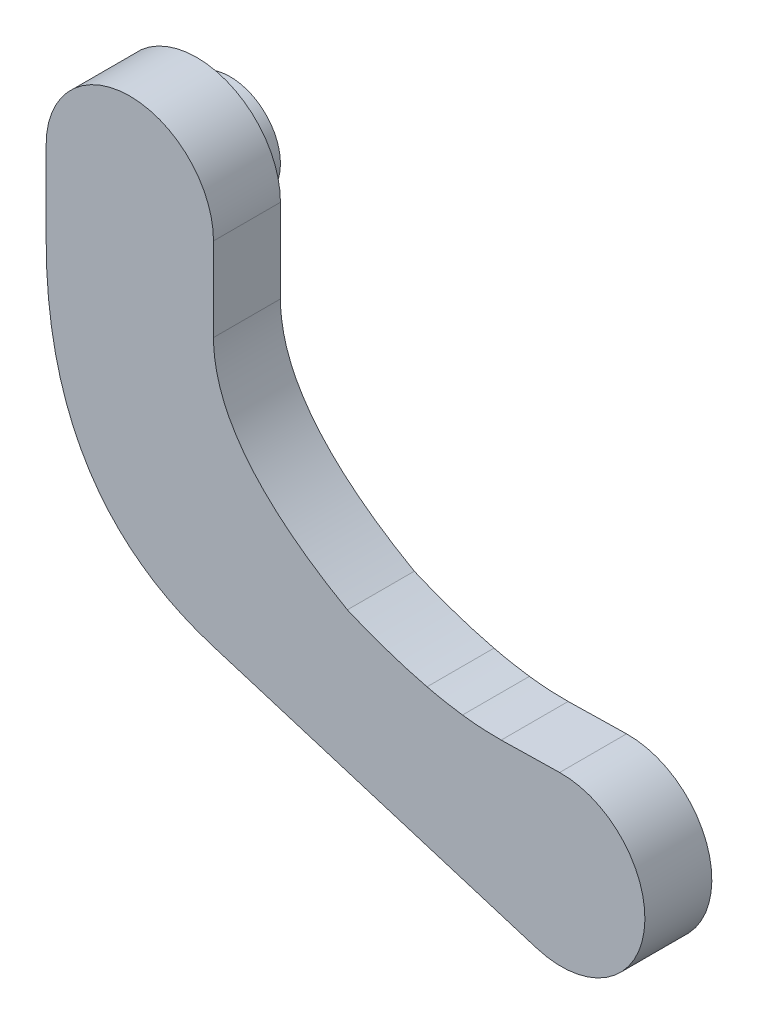
ISO-10303-21;
HEADER;
FILE_DESCRIPTION(('STEP AP214'),'2;1');
FILE_NAME('part.step','',(''),(''),'','','');
FILE_SCHEMA(('AUTOMOTIVE_DESIGN { 1 0 10303 214 1 1 1 1 }'));
ENDSEC;
DATA;
#1=APPLICATION_CONTEXT('core data for automotive mechanical design processes');
#2=APPLICATION_PROTOCOL_DEFINITION('international standard','automotive_design',2000,#1);
#3=PRODUCT_CONTEXT('',#1,'mechanical');
#4=PRODUCT('Part','Part','',(#3));
#5=PRODUCT_RELATED_PRODUCT_CATEGORY('part','',(#4));
#6=PRODUCT_DEFINITION_FORMATION('','',#4);
#7=PRODUCT_DEFINITION_CONTEXT('part definition',#1,'design');
#8=PRODUCT_DEFINITION('design','',#6,#7);
#9=PRODUCT_DEFINITION_SHAPE('','',#8);
#10=(LENGTH_UNIT() NAMED_UNIT(*) SI_UNIT(.MILLI.,.METRE.));
#11=(NAMED_UNIT(*) PLANE_ANGLE_UNIT() SI_UNIT($,.RADIAN.));
#12=(NAMED_UNIT(*) SI_UNIT($,.STERADIAN.) SOLID_ANGLE_UNIT());
#13=UNCERTAINTY_MEASURE_WITH_UNIT(LENGTH_MEASURE(1.E-05),#10,'distance_accuracy_value','');
#14=(GEOMETRIC_REPRESENTATION_CONTEXT(3) GLOBAL_UNCERTAINTY_ASSIGNED_CONTEXT((#13)) GLOBAL_UNIT_ASSIGNED_CONTEXT((#10,
#11,#12)) REPRESENTATION_CONTEXT('',''));
#15=CARTESIAN_POINT('',(0.,0.,0.));
#16=DIRECTION('',(0.,0.,1.));
#17=DIRECTION('',(1.,0.,0.));
#18=AXIS2_PLACEMENT_3D('',#15,#16,#17);
#19=CARTESIAN_POINT('',(18.9450892189157,4.95826516691605,-1.));
#20=DIRECTION('',(0.,0.,-1.));
#21=DIRECTION('',(0.,-1.,0.));
#22=AXIS2_PLACEMENT_3D('',#19,#20,#21);
#23=PLANE('',#22);
#24=CARTESIAN_POINT('',(12.5,10.5,-1.));
#25=DIRECTION('',(0.,0.,1.));
#26=DIRECTION('',(1.,0.,0.));
#27=AXIS2_PLACEMENT_3D('',#24,#25,#26);
#28=CIRCLE('',#27,1.5);
#29=CARTESIAN_POINT('',(14.,10.5,-1.));
#30=VERTEX_POINT('',#29);
#31=EDGE_CURVE('E11',#30,#30,#28,.T.);
#32=ORIENTED_EDGE('',*,*,#31,.F.);
#33=EDGE_LOOP('',(#32));
#34=FACE_BOUND('',#33,.T.);
#35=ADVANCED_FACE('F17',(#34),#23,.T.);
#36=CARTESIAN_POINT('',(12.5,10.5,-1.));
#37=DIRECTION('',(0.,0.,1.));
#38=DIRECTION('',(-1.,0.,0.));
#39=AXIS2_PLACEMENT_3D('',#36,#37,#38);
#40=CYLINDRICAL_SURFACE('',#39,1.5);
#41=CARTESIAN_POINT('',(12.5,10.5,0.));
#42=DIRECTION('',(0.,0.,1.));
#43=DIRECTION('',(1.,0.,0.));
#44=AXIS2_PLACEMENT_3D('',#41,#42,#43);
#45=CIRCLE('',#44,1.5);
#46=CARTESIAN_POINT('',(14.,10.5,0.));
#47=VERTEX_POINT('',#46);
#48=EDGE_CURVE('E27',#47,#47,#45,.T.);
#49=ORIENTED_EDGE('',*,*,#48,.F.);
#50=EDGE_LOOP('',(#49));
#51=FACE_BOUND('',#50,.T.);
#52=ORIENTED_EDGE('',*,*,#31,.T.);
#53=EDGE_LOOP('',(#52));
#54=FACE_BOUND('',#53,.T.);
#55=ADVANCED_FACE('F393',(#51,#54),#40,.T.);
#56=CARTESIAN_POINT('',(15.,4.95826516691604,0.));
#57=DIRECTION('',(0.,0.,1.));
#58=DIRECTION('',(1.,0.,0.));
#59=AXIS2_PLACEMENT_3D('',#56,#57,#58);
#60=PLANE('',#59);
#61=DIRECTION('',(-0.999812744567832,-0.0193513772052415,0.));
#62=VECTOR('',#61,1.);
#63=CARTESIAN_POINT('',(24.7776671423991,1.90514340302746,0.));
#64=LINE('',#63,#62);
#65=CARTESIAN_POINT('',(25.3417999948184,1.91606219525165,0.));
#66=VERTEX_POINT('',#65);
#67=CARTESIAN_POINT('',(23.5973931849003,1.88229919876904,0.));
#68=VERTEX_POINT('',#67);
#69=EDGE_CURVE('E175',#66,#68,#64,.T.);
#70=ORIENTED_EDGE('',*,*,#69,.F.);
#71=CARTESIAN_POINT('',(25.3901784378315,-0.58346966616792,0.));
#72=DIRECTION('',(0.,0.,-1.));
#73=DIRECTION('',(-1.,0.,0.));
#74=AXIS2_PLACEMENT_3D('',#71,#72,#73);
#75=CIRCLE('',#74,2.5);
#76=CARTESIAN_POINT('',(24.6544757225392,-2.97276695087561,0.));
#77=VERTEX_POINT('',#76);
#78=EDGE_CURVE('E301',#66,#77,#75,.T.);
#79=ORIENTED_EDGE('',*,*,#78,.T.);
#80=DIRECTION('',(0.955718913883073,-0.294281086116928,0.));
#81=VECTOR('',#80,1.);
#82=CARTESIAN_POINT('',(22.4382008114105,-2.29034058209032,0.));
#83=LINE('',#82,#81);
#84=CARTESIAN_POINT('',(15.,0.,0.));
#85=VERTEX_POINT('',#84);
#86=EDGE_CURVE('E186',#85,#77,#83,.T.);
#87=ORIENTED_EDGE('',*,*,#86,.F.);
#88=CARTESIAN_POINT('',(15.,0.,0.));
#89=CARTESIAN_POINT('',(13.5355339127904,0.450932449347952,0.));
#90=CARTESIAN_POINT('',(12.5000000096982,1.32400628140679,0.));
#91=(BOUNDED_CURVE() B_SPLINE_CURVE(2,(#88,#89,#90),.UNSPECIFIED.,.F.,
.F.) B_SPLINE_CURVE_WITH_KNOTS((3,3),(0.,0.292893217441925),
.UNSPECIFIED.) CURVE() GEOMETRIC_REPRESENTATION_ITEM() RATIONAL_B_SPLINE_CURVE((1.,1.,1.)) REPRESENTATION_ITEM(''));
#92=CARTESIAN_POINT('',(12.5000000096982,1.32400628140679,0.));
#93=VERTEX_POINT('',#92);
#94=EDGE_CURVE('E87',#85,#93,#91,.T.);
#95=ORIENTED_EDGE('',*,*,#94,.T.);
#96=CARTESIAN_POINT('',(12.5000000096982,1.32400628140679,0.));
#97=CARTESIAN_POINT('',(10.,3.43179298167471,0.));
#98=CARTESIAN_POINT('',(10.,8.,0.));
#99=(BOUNDED_CURVE() B_SPLINE_CURVE(2,(#96,#97,#98),.UNSPECIFIED.,.F.,
.F.) B_SPLINE_CURVE_WITH_KNOTS((3,3),(0.292893217441925,1.),
.UNSPECIFIED.) CURVE() GEOMETRIC_REPRESENTATION_ITEM() RATIONAL_B_SPLINE_CURVE((1.,1.,1.)) REPRESENTATION_ITEM(''));
#100=CARTESIAN_POINT('',(10.,8.,0.));
#101=VERTEX_POINT('',#100);
#102=EDGE_CURVE('E266',#93,#101,#99,.T.);
#103=ORIENTED_EDGE('',*,*,#102,.T.);
#104=DIRECTION('',(0.,1.,0.));
#105=VECTOR('',#104,1.);
#106=CARTESIAN_POINT('',(10.,9.25,0.));
#107=LINE('',#106,#105);
#108=CARTESIAN_POINT('',(10.,10.5,0.));
#109=VERTEX_POINT('',#108);
#110=EDGE_CURVE('E202',#101,#109,#107,.T.);
#111=ORIENTED_EDGE('',*,*,#110,.T.);
#112=CARTESIAN_POINT('',(12.5,10.5,0.));
#113=DIRECTION('',(0.,0.,1.));
#114=DIRECTION('',(-1.,0.,0.));
#115=AXIS2_PLACEMENT_3D('',#112,#113,#114);
#116=CIRCLE('',#115,2.5);
#117=CARTESIAN_POINT('',(15.,10.5,0.));
#118=VERTEX_POINT('',#117);
#119=EDGE_CURVE('E190',#118,#109,#116,.T.);
#120=ORIENTED_EDGE('',*,*,#119,.F.);
#121=DIRECTION('',(0.,-1.,0.));
#122=VECTOR('',#121,1.);
#123=CARTESIAN_POINT('',(15.,8.17520207152069,0.));
#124=LINE('',#123,#122);
#125=CARTESIAN_POINT('',(15.,8.,0.));
#126=VERTEX_POINT('',#125);
#127=EDGE_CURVE('E258',#118,#126,#124,.T.);
#128=ORIENTED_EDGE('',*,*,#127,.T.);
#129=CARTESIAN_POINT('',(19.,2.95366724936204,0.));
#130=CARTESIAN_POINT('',(15.,5.23166375318981,0.));
#131=CARTESIAN_POINT('',(15.,8.,0.));
#132=(BOUNDED_CURVE() B_SPLINE_CURVE(2,(#129,#130,#131),.UNSPECIFIED.,.F.,
.F.) B_SPLINE_CURVE_WITH_KNOTS((3,3),(0.,1.),
.UNSPECIFIED.) CURVE() GEOMETRIC_REPRESENTATION_ITEM() RATIONAL_B_SPLINE_CURVE((1.,1.,1.)) REPRESENTATION_ITEM(''));
#133=CARTESIAN_POINT('',(19.,2.95366724936204,0.));
#134=VERTEX_POINT('',#133);
#135=EDGE_CURVE('E155',#134,#126,#132,.T.);
#136=ORIENTED_EDGE('',*,*,#135,.F.);
#137=CARTESIAN_POINT('',(21.3798526232398,2.15261447615738,0.));
#138=CARTESIAN_POINT('',(20.2652084525949,2.4206888880086,0.));
#139=CARTESIAN_POINT('',(19.,2.95366724936204,0.));
#140=(BOUNDED_CURVE() B_SPLINE_CURVE(2,(#137,#138,#139),.UNSPECIFIED.,.F.,
.F.) B_SPLINE_CURVE_WITH_KNOTS((3,3),(0.517468519952534,1.),
.UNSPECIFIED.) CURVE() GEOMETRIC_REPRESENTATION_ITEM() RATIONAL_B_SPLINE_CURVE((1.,1.,1.)) REPRESENTATION_ITEM(''));
#141=CARTESIAN_POINT('',(21.379852620456,2.15261447701456,0.));
#142=VERTEX_POINT('',#141);
#143=EDGE_CURVE('E139',#142,#134,#140,.T.);
#144=ORIENTED_EDGE('',*,*,#143,.F.);
#145=CARTESIAN_POINT('',(22.4403096712738,1.95294060461028,0.));
#146=CARTESIAN_POINT('',(21.9283075673137,2.02070983750089,0.));
#147=CARTESIAN_POINT('',(21.3798526232398,2.15261447615738,0.));
#148=(BOUNDED_CURVE() B_SPLINE_CURVE(2,(#145,#146,#147),.UNSPECIFIED.,.F.,
.F.) B_SPLINE_CURVE_WITH_KNOTS((3,3),(0.280041381433362,0.517468519952534),
.UNSPECIFIED.) CURVE() GEOMETRIC_REPRESENTATION_ITEM() RATIONAL_B_SPLINE_CURVE((1.,1.,1.)) REPRESENTATION_ITEM(''));
#149=CARTESIAN_POINT('',(22.4403096712738,1.95294060461028,0.));
#150=VERTEX_POINT('',#149);
#151=EDGE_CURVE('E117',#150,#142,#148,.T.);
#152=ORIENTED_EDGE('',*,*,#151,.F.);
#153=CARTESIAN_POINT('',(23.5973931849003,1.88229919876904,0.));
#154=CARTESIAN_POINT('',(23.0442076813498,1.87300791571998,0.));
#155=CARTESIAN_POINT('',(22.4403096712738,1.95294060461028,0.));
#156=(BOUNDED_CURVE() B_SPLINE_CURVE(2,(#153,#154,#155),.UNSPECIFIED.,.F.,
.F.) B_SPLINE_CURVE_WITH_KNOTS((3,3),(0.,0.280041381433362),
.UNSPECIFIED.) CURVE() GEOMETRIC_REPRESENTATION_ITEM() RATIONAL_B_SPLINE_CURVE((1.,1.,1.)) REPRESENTATION_ITEM(''));
#157=EDGE_CURVE('E285',#68,#150,#156,.T.);
#158=ORIENTED_EDGE('',*,*,#157,.F.);
#159=EDGE_LOOP('',(#70,#79,#87,#95,#103,#111,#120,#128,#136,#144,#152,#158));
#160=FACE_BOUND('',#159,.T.);
#161=ORIENTED_EDGE('',*,*,#48,.T.);
#162=EDGE_LOOP('',(#161));
#163=FACE_BOUND('',#162,.T.);
#164=ADVANCED_FACE('F344',(#160,#163),#60,.F.);
#165=CARTESIAN_POINT('',(15.,4.95826516691604,2.));
#166=DIRECTION('',(0.,0.,1.));
#167=DIRECTION('',(1.,0.,0.));
#168=AXIS2_PLACEMENT_3D('',#165,#166,#167);
#169=PLANE('',#168);
#170=DIRECTION('',(-0.999812744567832,-0.0193513772052415,0.));
#171=VECTOR('',#170,1.);
#172=CARTESIAN_POINT('',(24.7776671423991,1.90514340302746,2.));
#173=LINE('',#172,#171);
#174=CARTESIAN_POINT('',(25.3417999948184,1.91606219525165,2.));
#175=VERTEX_POINT('',#174);
#176=CARTESIAN_POINT('',(23.5973931849003,1.88229919876904,2.));
#177=VERTEX_POINT('',#176);
#178=EDGE_CURVE('E174',#175,#177,#173,.T.);
#179=ORIENTED_EDGE('',*,*,#178,.T.);
#180=CARTESIAN_POINT('',(23.5973931849003,1.88229919876904,2.));
#181=CARTESIAN_POINT('',(23.0442076813498,1.87300791571998,2.));
#182=CARTESIAN_POINT('',(22.4403096712738,1.95294060461028,2.));
#183=(BOUNDED_CURVE() B_SPLINE_CURVE(2,(#180,#181,#182),.UNSPECIFIED.,.F.,
.F.) B_SPLINE_CURVE_WITH_KNOTS((3,3),(0.,0.280041381433362),
.UNSPECIFIED.) CURVE() GEOMETRIC_REPRESENTATION_ITEM() RATIONAL_B_SPLINE_CURVE((1.,1.,1.)) REPRESENTATION_ITEM(''));
#184=CARTESIAN_POINT('',(22.4403096712738,1.95294060461028,2.));
#185=VERTEX_POINT('',#184);
#186=EDGE_CURVE('E257',#177,#185,#183,.T.);
#187=ORIENTED_EDGE('',*,*,#186,.T.);
#188=CARTESIAN_POINT('',(22.4403096712738,1.95294060461028,2.));
#189=CARTESIAN_POINT('',(21.9283075673137,2.02070983750089,2.));
#190=CARTESIAN_POINT('',(21.3798526232398,2.15261447615738,2.));
#191=(BOUNDED_CURVE() B_SPLINE_CURVE(2,(#188,#189,#190),.UNSPECIFIED.,.F.,
.F.) B_SPLINE_CURVE_WITH_KNOTS((3,3),(0.280041381433362,0.517468519952534),
.UNSPECIFIED.) CURVE() GEOMETRIC_REPRESENTATION_ITEM() RATIONAL_B_SPLINE_CURVE((1.,1.,1.)) REPRESENTATION_ITEM(''));
#192=CARTESIAN_POINT('',(21.379852620456,2.15261447701456,2.));
#193=VERTEX_POINT('',#192);
#194=EDGE_CURVE('E135',#185,#193,#191,.T.);
#195=ORIENTED_EDGE('',*,*,#194,.T.);
#196=CARTESIAN_POINT('',(21.3798526232398,2.15261447615738,2.));
#197=CARTESIAN_POINT('',(20.2652084525949,2.4206888880086,2.));
#198=CARTESIAN_POINT('',(19.,2.95366724936204,2.));
#199=(BOUNDED_CURVE() B_SPLINE_CURVE(2,(#196,#197,#198),.UNSPECIFIED.,.F.,
.F.) B_SPLINE_CURVE_WITH_KNOTS((3,3),(0.517468519952534,1.),
.UNSPECIFIED.) CURVE() GEOMETRIC_REPRESENTATION_ITEM() RATIONAL_B_SPLINE_CURVE((1.,1.,1.)) REPRESENTATION_ITEM(''));
#200=CARTESIAN_POINT('',(19.,2.95366724936204,2.));
#201=VERTEX_POINT('',#200);
#202=EDGE_CURVE('E127',#193,#201,#199,.T.);
#203=ORIENTED_EDGE('',*,*,#202,.T.);
#204=CARTESIAN_POINT('',(19.,2.95366724936204,2.));
#205=CARTESIAN_POINT('',(15.,5.23166375318981,2.));
#206=CARTESIAN_POINT('',(15.,8.,2.));
#207=(BOUNDED_CURVE() B_SPLINE_CURVE(2,(#204,#205,#206),.UNSPECIFIED.,.F.,
.F.) B_SPLINE_CURVE_WITH_KNOTS((3,3),(0.,1.),
.UNSPECIFIED.) CURVE() GEOMETRIC_REPRESENTATION_ITEM() RATIONAL_B_SPLINE_CURVE((1.,1.,1.)) REPRESENTATION_ITEM(''));
#208=CARTESIAN_POINT('',(15.,8.,2.));
#209=VERTEX_POINT('',#208);
#210=EDGE_CURVE('E132',#201,#209,#207,.T.);
#211=ORIENTED_EDGE('',*,*,#210,.T.);
#212=DIRECTION('',(0.,-1.,0.));
#213=VECTOR('',#212,1.);
#214=CARTESIAN_POINT('',(15.,8.17520207152069,2.));
#215=LINE('',#214,#213);
#216=CARTESIAN_POINT('',(15.,10.5,2.));
#217=VERTEX_POINT('',#216);
#218=EDGE_CURVE('E222',#217,#209,#215,.T.);
#219=ORIENTED_EDGE('',*,*,#218,.F.);
#220=CARTESIAN_POINT('',(12.5,10.5,2.));
#221=DIRECTION('',(0.,0.,1.));
#222=DIRECTION('',(-1.,0.,0.));
#223=AXIS2_PLACEMENT_3D('',#220,#221,#222);
#224=CIRCLE('',#223,2.5);
#225=CARTESIAN_POINT('',(10.,10.5,2.));
#226=VERTEX_POINT('',#225);
#227=EDGE_CURVE('E200',#217,#226,#224,.T.);
#228=ORIENTED_EDGE('',*,*,#227,.T.);
#229=DIRECTION('',(0.,1.,0.));
#230=VECTOR('',#229,1.);
#231=CARTESIAN_POINT('',(10.,9.25,2.));
#232=LINE('',#231,#230);
#233=CARTESIAN_POINT('',(10.,8.,2.));
#234=VERTEX_POINT('',#233);
#235=EDGE_CURVE('E166',#234,#226,#232,.T.);
#236=ORIENTED_EDGE('',*,*,#235,.F.);
#237=CARTESIAN_POINT('',(12.5000000096982,1.32400628140679,2.));
#238=CARTESIAN_POINT('',(10.,3.43179298167471,2.));
#239=CARTESIAN_POINT('',(10.,8.,2.));
#240=(BOUNDED_CURVE() B_SPLINE_CURVE(2,(#237,#238,#239),.UNSPECIFIED.,.F.,
.F.) B_SPLINE_CURVE_WITH_KNOTS((3,3),(0.292893217441925,1.),
.UNSPECIFIED.) CURVE() GEOMETRIC_REPRESENTATION_ITEM() RATIONAL_B_SPLINE_CURVE((1.,1.,1.)) REPRESENTATION_ITEM(''));
#241=CARTESIAN_POINT('',(12.5000000096982,1.32400628140679,2.));
#242=VERTEX_POINT('',#241);
#243=EDGE_CURVE('E218',#242,#234,#240,.T.);
#244=ORIENTED_EDGE('',*,*,#243,.F.);
#245=CARTESIAN_POINT('',(15.,0.,2.));
#246=CARTESIAN_POINT('',(13.5355339127904,0.450932449347952,2.));
#247=CARTESIAN_POINT('',(12.5000000096982,1.32400628140679,2.));
#248=(BOUNDED_CURVE() B_SPLINE_CURVE(2,(#245,#246,#247),.UNSPECIFIED.,.F.,
.F.) B_SPLINE_CURVE_WITH_KNOTS((3,3),(0.,0.292893217441925),
.UNSPECIFIED.) CURVE() GEOMETRIC_REPRESENTATION_ITEM() RATIONAL_B_SPLINE_CURVE((1.,1.,1.)) REPRESENTATION_ITEM(''));
#249=CARTESIAN_POINT('',(15.,0.,2.));
#250=VERTEX_POINT('',#249);
#251=EDGE_CURVE('E75',#250,#242,#248,.T.);
#252=ORIENTED_EDGE('',*,*,#251,.F.);
#253=DIRECTION('',(0.955718913883073,-0.294281086116928,0.));
#254=VECTOR('',#253,1.);
#255=CARTESIAN_POINT('',(22.4382008114105,-2.29034058209032,2.));
#256=LINE('',#255,#254);
#257=CARTESIAN_POINT('',(24.6544757225392,-2.97276695087561,2.));
#258=VERTEX_POINT('',#257);
#259=EDGE_CURVE('E183',#250,#258,#256,.T.);
#260=ORIENTED_EDGE('',*,*,#259,.T.);
#261=CARTESIAN_POINT('',(25.3901784378315,-0.58346966616792,2.));
#262=DIRECTION('',(0.,0.,-1.));
#263=DIRECTION('',(-1.,0.,0.));
#264=AXIS2_PLACEMENT_3D('',#261,#262,#263);
#265=CIRCLE('',#264,2.5);
#266=EDGE_CURVE('E293',#175,#258,#265,.T.);
#267=ORIENTED_EDGE('',*,*,#266,.F.);
#268=EDGE_LOOP('',(#179,#187,#195,#203,#211,#219,#228,#236,#244,#252,#260,#267));
#269=FACE_BOUND('',#268,.T.);
#270=ADVANCED_FACE('F130',(#269),#169,.T.);
#271=CARTESIAN_POINT('',(23.5973931849003,1.88229919876904,2.));
#272=CARTESIAN_POINT('',(23.5973931849003,1.88229919876904,0.));
#273=CARTESIAN_POINT('',(23.2286028492,1.87610501006967,2.));
#274=CARTESIAN_POINT('',(23.2286028492,1.87610501006967,0.));
#275=CARTESIAN_POINT('',(22.8429083446578,1.89965214535008,2.));
#276=CARTESIAN_POINT('',(22.8429083446578,1.89965214535008,0.));
#277=CARTESIAN_POINT('',(22.4403096712738,1.95294060461028,2.));
#278=CARTESIAN_POINT('',(22.4403096712738,1.95294060461028,0.));
#279=(BOUNDED_SURFACE() B_SPLINE_SURFACE(3,1,((#271,#272),(#273,#274),(#275,#276),(#277,#278)),
.UNSPECIFIED.,.F.,.F.,.F.) B_SPLINE_SURFACE_WITH_KNOTS((4,4),(2,2),(0.,0.280041381433362),(0.,
1.),.UNSPECIFIED.) GEOMETRIC_REPRESENTATION_ITEM() RATIONAL_B_SPLINE_SURFACE(((1.,1.),(1.,1.),
(1.,1.),(1.,1.))) REPRESENTATION_ITEM('') SURFACE());
#280=DIRECTION('',(0.,0.,-1.));
#281=VECTOR('',#280,1.);
#282=CARTESIAN_POINT('',(22.4403096712738,1.95294060461028,2.));
#283=LINE('',#282,#281);
#284=EDGE_CURVE('E237',#185,#150,#283,.T.);
#285=DIRECTION('',(0.,0.,-1.));
#286=VECTOR('',#285,1.);
#287=CARTESIAN_POINT('',(23.5973931849003,1.88229919876904,2.));
#288=LINE('',#287,#286);
#289=EDGE_CURVE('E168',#177,#68,#288,.T.);
#290=ORIENTED_EDGE('',*,*,#157,.T.);
#291=ORIENTED_EDGE('',*,*,#284,.F.);
#292=ORIENTED_EDGE('',*,*,#186,.F.);
#293=ORIENTED_EDGE('',*,*,#289,.T.);
#294=EDGE_LOOP('',(#290,#291,#292,#293));
#295=FACE_BOUND('',#294,.T.);
#296=ADVANCED_FACE('F426',(#295),#279,.F.);
#297=CARTESIAN_POINT('',(22.4403096712738,1.95294060461028,2.));
#298=CARTESIAN_POINT('',(22.4403096712738,1.95294060461028,0.));
#299=CARTESIAN_POINT('',(22.0989749353004,1.99812009320402,2.));
#300=CARTESIAN_POINT('',(22.0989749353004,1.99812009320402,0.));
#301=CARTESIAN_POINT('',(21.7454892526224,2.06467805038639,2.));
#302=CARTESIAN_POINT('',(21.7454892526224,2.06467805038639,0.));
#303=CARTESIAN_POINT('',(21.3798526232398,2.15261447615738,2.));
#304=CARTESIAN_POINT('',(21.3798526232398,2.15261447615738,0.));
#305=(BOUNDED_SURFACE() B_SPLINE_SURFACE(3,1,((#297,#298),(#299,#300),(#301,#302),(#303,#304)),
.UNSPECIFIED.,.F.,.F.,.F.) B_SPLINE_SURFACE_WITH_KNOTS((4,4),(2,2),(0.280041381433362,
0.517468519952534),(0.,1.),
.UNSPECIFIED.) GEOMETRIC_REPRESENTATION_ITEM() RATIONAL_B_SPLINE_SURFACE(((1.,1.),(1.,1.),(1.,
1.),(1.,1.))) REPRESENTATION_ITEM('') SURFACE());
#306=DIRECTION('',(0.,0.,-1.));
#307=VECTOR('',#306,1.);
#308=CARTESIAN_POINT('',(21.379852620456,2.15261447701456,2.));
#309=LINE('',#308,#307);
#310=EDGE_CURVE('E138',#193,#142,#309,.T.);
#311=ORIENTED_EDGE('',*,*,#151,.T.);
#312=ORIENTED_EDGE('',*,*,#310,.F.);
#313=ORIENTED_EDGE('',*,*,#194,.F.);
#314=ORIENTED_EDGE('',*,*,#284,.T.);
#315=EDGE_LOOP('',(#311,#312,#313,#314));
#316=FACE_BOUND('',#315,.T.);
#317=ADVANCED_FACE('F338',(#316),#305,.F.);
#318=CARTESIAN_POINT('',(21.3798526232398,2.15261447615738,2.));
#319=CARTESIAN_POINT('',(21.3798526232398,2.15261447615738,0.));
#320=CARTESIAN_POINT('',(20.6367565094766,2.33133075072486,2.));
#321=CARTESIAN_POINT('',(20.6367565094766,2.33133075072486,0.));
#322=CARTESIAN_POINT('',(19.8434723017299,2.59834834179308,2.));
#323=CARTESIAN_POINT('',(19.8434723017299,2.59834834179308,0.));
#324=CARTESIAN_POINT('',(19.,2.95366724936204,2.));
#325=CARTESIAN_POINT('',(19.,2.95366724936204,0.));
#326=(BOUNDED_SURFACE() B_SPLINE_SURFACE(3,1,((#318,#319),(#320,#321),(#322,#323),(#324,#325)),
.UNSPECIFIED.,.F.,.F.,.F.) B_SPLINE_SURFACE_WITH_KNOTS((4,4),(2,2),(0.517468519952534,1.),(0.,
1.),.UNSPECIFIED.) GEOMETRIC_REPRESENTATION_ITEM() RATIONAL_B_SPLINE_SURFACE(((1.,1.),(1.,1.),
(1.,1.),(1.,1.))) REPRESENTATION_ITEM('') SURFACE());
#327=DIRECTION('',(0.,0.,-1.));
#328=VECTOR('',#327,1.);
#329=CARTESIAN_POINT('',(19.,2.95366724936204,2.));
#330=LINE('',#329,#328);
#331=EDGE_CURVE('E142',#201,#134,#330,.T.);
#332=ORIENTED_EDGE('',*,*,#143,.T.);
#333=ORIENTED_EDGE('',*,*,#331,.F.);
#334=ORIENTED_EDGE('',*,*,#202,.F.);
#335=ORIENTED_EDGE('',*,*,#310,.T.);
#336=EDGE_LOOP('',(#332,#333,#334,#335));
#337=FACE_BOUND('',#336,.T.);
#338=ADVANCED_FACE('F143',(#337),#326,.F.);
#339=CARTESIAN_POINT('',(19.,2.95366724936204,2.));
#340=CARTESIAN_POINT('',(19.,2.95366724936204,0.));
#341=CARTESIAN_POINT('',(16.3333333333333,4.47233158524722,2.));
#342=CARTESIAN_POINT('',(16.3333333333333,4.47233158524722,0.));
#343=CARTESIAN_POINT('',(15.,6.15444250212654,2.));
#344=CARTESIAN_POINT('',(15.,6.15444250212654,0.));
#345=CARTESIAN_POINT('',(15.,8.,2.));
#346=CARTESIAN_POINT('',(15.,8.,0.));
#347=(BOUNDED_SURFACE() B_SPLINE_SURFACE(3,1,((#339,#340),(#341,#342),(#343,#344),(#345,#346)),
.UNSPECIFIED.,.F.,.F.,.F.) B_SPLINE_SURFACE_WITH_KNOTS((4,4),(2,2),(0.,1.),(0.,1.),
.UNSPECIFIED.) GEOMETRIC_REPRESENTATION_ITEM() RATIONAL_B_SPLINE_SURFACE(((1.,1.),(1.,1.),(1.,
1.),(1.,1.))) REPRESENTATION_ITEM('') SURFACE());
#348=DIRECTION('',(0.,0.,-1.));
#349=VECTOR('',#348,1.);
#350=CARTESIAN_POINT('',(15.,8.,2.));
#351=LINE('',#350,#349);
#352=EDGE_CURVE('E152',#209,#126,#351,.T.);
#353=ORIENTED_EDGE('',*,*,#135,.T.);
#354=ORIENTED_EDGE('',*,*,#352,.F.);
#355=ORIENTED_EDGE('',*,*,#210,.F.);
#356=ORIENTED_EDGE('',*,*,#331,.T.);
#357=EDGE_LOOP('',(#353,#354,#355,#356));
#358=FACE_BOUND('',#357,.T.);
#359=ADVANCED_FACE('F150',(#358),#347,.F.);
#360=CARTESIAN_POINT('',(15.,8.17520207152069,2.));
#361=DIRECTION('',(-1.,0.,0.));
#362=DIRECTION('',(0.,0.,1.));
#363=AXIS2_PLACEMENT_3D('',#360,#361,#362);
#364=PLANE('',#363);
#365=ORIENTED_EDGE('',*,*,#127,.F.);
#366=DIRECTION('',(0.,0.,-1.));
#367=VECTOR('',#366,1.);
#368=CARTESIAN_POINT('',(15.,10.5,2.));
#369=LINE('',#368,#367);
#370=EDGE_CURVE('E226',#217,#118,#369,.T.);
#371=ORIENTED_EDGE('',*,*,#370,.F.);
#372=ORIENTED_EDGE('',*,*,#218,.T.);
#373=ORIENTED_EDGE('',*,*,#352,.T.);
#374=EDGE_LOOP('',(#365,#371,#372,#373));
#375=FACE_BOUND('',#374,.T.);
#376=ADVANCED_FACE('F348',(#375),#364,.F.);
#377=CARTESIAN_POINT('',(12.5,10.5,2.));
#378=DIRECTION('',(0.,0.,-1.));
#379=DIRECTION('',(1.,0.,0.));
#380=AXIS2_PLACEMENT_3D('',#377,#378,#379);
#381=CYLINDRICAL_SURFACE('',#380,2.5);
#382=ORIENTED_EDGE('',*,*,#119,.T.);
#383=DIRECTION('',(0.,0.,-1.));
#384=VECTOR('',#383,1.);
#385=CARTESIAN_POINT('',(10.,10.5,2.));
#386=LINE('',#385,#384);
#387=EDGE_CURVE('E187',#226,#109,#386,.T.);
#388=ORIENTED_EDGE('',*,*,#387,.F.);
#389=ORIENTED_EDGE('',*,*,#227,.F.);
#390=ORIENTED_EDGE('',*,*,#370,.T.);
#391=EDGE_LOOP('',(#382,#388,#389,#390));
#392=FACE_BOUND('',#391,.T.);
#393=ADVANCED_FACE('F356',(#392),#381,.T.);
#394=CARTESIAN_POINT('',(10.,9.25,2.));
#395=DIRECTION('',(1.,0.,0.));
#396=DIRECTION('',(0.,1.,0.));
#397=AXIS2_PLACEMENT_3D('',#394,#395,#396);
#398=PLANE('',#397);
#399=ORIENTED_EDGE('',*,*,#110,.F.);
#400=DIRECTION('',(0.,0.,-1.));
#401=VECTOR('',#400,1.);
#402=CARTESIAN_POINT('',(10.,8.,2.));
#403=LINE('',#402,#401);
#404=EDGE_CURVE('E208',#234,#101,#403,.T.);
#405=ORIENTED_EDGE('',*,*,#404,.F.);
#406=ORIENTED_EDGE('',*,*,#235,.T.);
#407=ORIENTED_EDGE('',*,*,#387,.T.);
#408=EDGE_LOOP('',(#399,#405,#406,#407));
#409=FACE_BOUND('',#408,.T.);
#410=ADVANCED_FACE('F409',(#409),#398,.F.);
#411=CARTESIAN_POINT('',(12.5000000096982,1.32400628140679,2.));
#412=CARTESIAN_POINT('',(12.5000000096982,1.32400628140679,0.));
#413=CARTESIAN_POINT('',(10.8333333365661,2.72919741491874,2.));
#414=CARTESIAN_POINT('',(10.8333333365661,2.72919741491874,0.));
#415=CARTESIAN_POINT('',(10.,4.95452865444981,2.));
#416=CARTESIAN_POINT('',(10.,4.95452865444981,0.));
#417=CARTESIAN_POINT('',(10.,8.,2.));
#418=CARTESIAN_POINT('',(10.,8.,0.));
#419=(BOUNDED_SURFACE() B_SPLINE_SURFACE(3,1,((#411,#412),(#413,#414),(#415,#416),(#417,#418)),
.UNSPECIFIED.,.F.,.F.,.F.) B_SPLINE_SURFACE_WITH_KNOTS((4,4),(2,2),(0.292893217441925,1.),(0.,
1.),.UNSPECIFIED.) GEOMETRIC_REPRESENTATION_ITEM() RATIONAL_B_SPLINE_SURFACE(((1.,1.),(1.,1.),
(1.,1.),(1.,1.))) REPRESENTATION_ITEM('') SURFACE());
#420=DIRECTION('',(0.,0.,-1.));
#421=VECTOR('',#420,1.);
#422=CARTESIAN_POINT('',(12.5000000096982,1.32400628140679,2.));
#423=LINE('',#422,#421);
#424=EDGE_CURVE('E309',#242,#93,#423,.T.);
#425=ORIENTED_EDGE('',*,*,#102,.F.);
#426=ORIENTED_EDGE('',*,*,#424,.F.);
#427=ORIENTED_EDGE('',*,*,#243,.T.);
#428=ORIENTED_EDGE('',*,*,#404,.T.);
#429=EDGE_LOOP('',(#425,#426,#427,#428));
#430=FACE_BOUND('',#429,.T.);
#431=ADVANCED_FACE('F418',(#430),#419,.T.);
#432=CARTESIAN_POINT('',(15.,0.,2.));
#433=CARTESIAN_POINT('',(15.,0.,0.));
#434=CARTESIAN_POINT('',(14.0236892751936,0.300621632898634,2.));
#435=CARTESIAN_POINT('',(14.0236892751936,0.300621632898634,0.));
#436=CARTESIAN_POINT('',(13.190355945093,0.74195706003423,2.));
#437=CARTESIAN_POINT('',(13.190355945093,0.74195706003423,0.));
#438=CARTESIAN_POINT('',(12.5000000096982,1.32400628140679,2.));
#439=CARTESIAN_POINT('',(12.5000000096982,1.32400628140679,0.));
#440=(BOUNDED_SURFACE() B_SPLINE_SURFACE(3,1,((#432,#433),(#434,#435),(#436,#437),(#438,#439)),
.UNSPECIFIED.,.F.,.F.,.F.) B_SPLINE_SURFACE_WITH_KNOTS((4,4),(2,2),(0.,0.292893217441925),(0.,
1.),.UNSPECIFIED.) GEOMETRIC_REPRESENTATION_ITEM() RATIONAL_B_SPLINE_SURFACE(((1.,1.),(1.,1.),
(1.,1.),(1.,1.))) REPRESENTATION_ITEM('') SURFACE());
#441=DIRECTION('',(0.,0.,-1.));
#442=VECTOR('',#441,1.);
#443=CARTESIAN_POINT('',(15.,0.,2.));
#444=LINE('',#443,#442);
#445=EDGE_CURVE('E185',#250,#85,#444,.T.);
#446=ORIENTED_EDGE('',*,*,#94,.F.);
#447=ORIENTED_EDGE('',*,*,#445,.F.);
#448=ORIENTED_EDGE('',*,*,#251,.T.);
#449=ORIENTED_EDGE('',*,*,#424,.T.);
#450=EDGE_LOOP('',(#446,#447,#448,#449));
#451=FACE_BOUND('',#450,.T.);
#452=ADVANCED_FACE('F414',(#451),#440,.T.);
#453=CARTESIAN_POINT('',(22.4382008114105,-2.29034058209032,2.));
#454=DIRECTION('',(-0.294281086116928,-0.955718913883073,0.));
#455=DIRECTION('',(-0.955718913883073,0.294281086116928,0.));
#456=AXIS2_PLACEMENT_3D('',#453,#454,#455);
#457=PLANE('',#456);
#458=ORIENTED_EDGE('',*,*,#86,.T.);
#459=DIRECTION('',(0.,0.,-1.));
#460=VECTOR('',#459,1.);
#461=CARTESIAN_POINT('',(24.6544757225392,-2.97276695087561,2.));
#462=LINE('',#461,#460);
#463=EDGE_CURVE('E300',#258,#77,#462,.T.);
#464=ORIENTED_EDGE('',*,*,#463,.F.);
#465=ORIENTED_EDGE('',*,*,#259,.F.);
#466=ORIENTED_EDGE('',*,*,#445,.T.);
#467=EDGE_LOOP('',(#458,#464,#465,#466));
#468=FACE_BOUND('',#467,.T.);
#469=ADVANCED_FACE('F376',(#468),#457,.T.);
#470=CARTESIAN_POINT('',(25.3901784378315,-0.58346966616792,2.));
#471=DIRECTION('',(0.,0.,-1.));
#472=DIRECTION('',(1.,0.,0.));
#473=AXIS2_PLACEMENT_3D('',#470,#471,#472);
#474=CYLINDRICAL_SURFACE('',#473,2.5);
#475=ORIENTED_EDGE('',*,*,#78,.F.);
#476=DIRECTION('',(0.,0.,-1.));
#477=VECTOR('',#476,1.);
#478=CARTESIAN_POINT('',(25.3417999948184,1.91606219525165,2.));
#479=LINE('',#478,#477);
#480=EDGE_CURVE('E20',#175,#66,#479,.T.);
#481=ORIENTED_EDGE('',*,*,#480,.F.);
#482=ORIENTED_EDGE('',*,*,#266,.T.);
#483=ORIENTED_EDGE('',*,*,#463,.T.);
#484=EDGE_LOOP('',(#475,#481,#482,#483));
#485=FACE_BOUND('',#484,.T.);
#486=ADVANCED_FACE('F380',(#485),#474,.T.);
#487=CARTESIAN_POINT('',(24.7776671423991,1.90514340302746,2.));
#488=DIRECTION('',(-0.0193513772052415,0.999812744567832,0.));
#489=DIRECTION('',(0.,0.,1.));
#490=AXIS2_PLACEMENT_3D('',#487,#488,#489);
#491=PLANE('',#490);
#492=ORIENTED_EDGE('',*,*,#69,.T.);
#493=ORIENTED_EDGE('',*,*,#289,.F.);
#494=ORIENTED_EDGE('',*,*,#178,.F.);
#495=ORIENTED_EDGE('',*,*,#480,.T.);
#496=EDGE_LOOP('',(#492,#493,#494,#495));
#497=FACE_BOUND('',#496,.T.);
#498=ADVANCED_FACE('F385',(#497),#491,.T.);
#499=CLOSED_SHELL('',(#35,#55,#164,#270,#296,#317,#338,#359,#376,#393,#410,#431,#452,#469,#486,#498));
#500=MANIFOLD_SOLID_BREP('B1',#499);
#501=ADVANCED_BREP_SHAPE_REPRESENTATION('',(#18,#500),#14);
#502=SHAPE_DEFINITION_REPRESENTATION(#9,#501);
ENDSEC;
END-ISO-10303-21;
